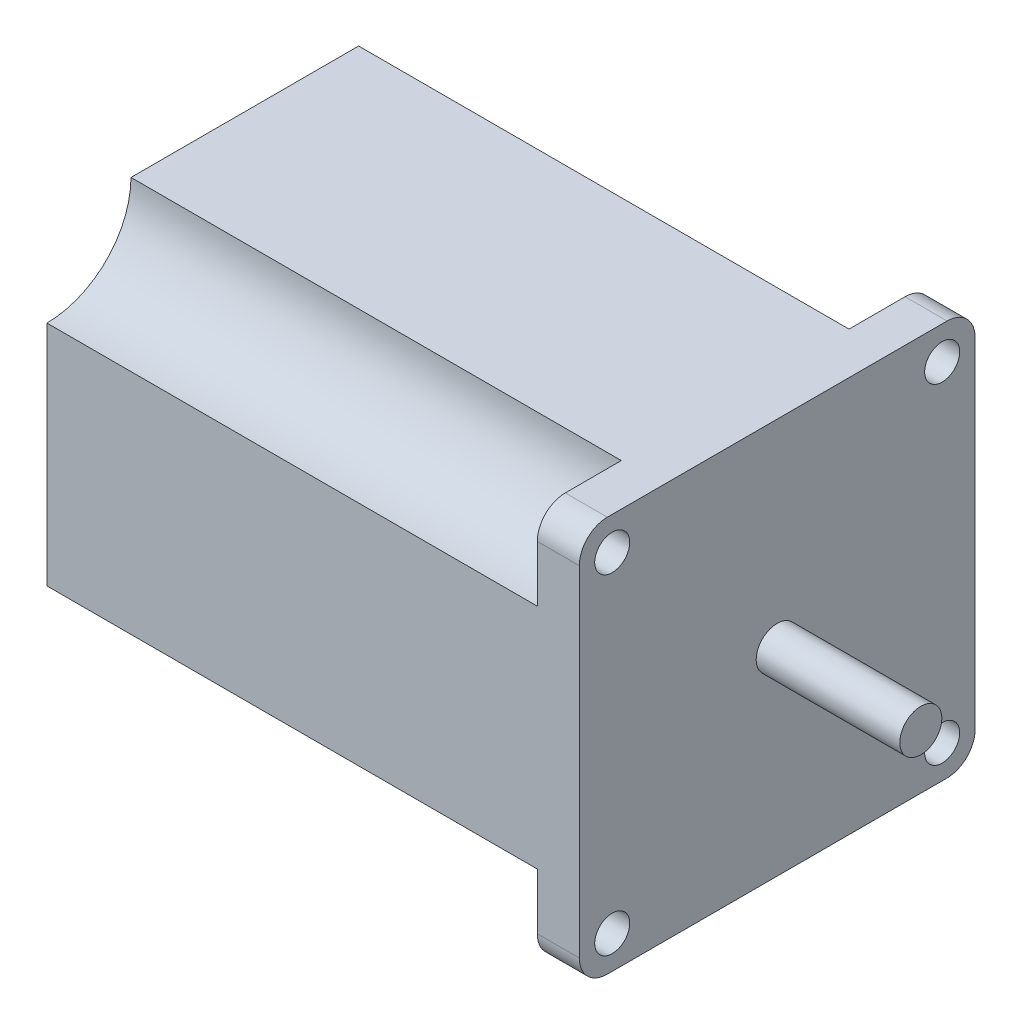
ISO-10303-21;
HEADER;
FILE_DESCRIPTION(('STEP AP214'),'2;1');
FILE_NAME('part.step','',(''),(''),'','','');
FILE_SCHEMA(('AUTOMOTIVE_DESIGN { 1 0 10303 214 1 1 1 1 }'));
ENDSEC;
DATA;
#1=APPLICATION_CONTEXT('core data for automotive mechanical design processes');
#2=APPLICATION_PROTOCOL_DEFINITION('international standard','automotive_design',2000,#1);
#3=PRODUCT_CONTEXT('',#1,'mechanical');
#4=PRODUCT('Part','Part','',(#3));
#5=PRODUCT_RELATED_PRODUCT_CATEGORY('part','',(#4));
#6=PRODUCT_DEFINITION_FORMATION('','',#4);
#7=PRODUCT_DEFINITION_CONTEXT('part definition',#1,'design');
#8=PRODUCT_DEFINITION('design','',#6,#7);
#9=PRODUCT_DEFINITION_SHAPE('','',#8);
#10=(LENGTH_UNIT() NAMED_UNIT(*) SI_UNIT(.MILLI.,.METRE.));
#11=(NAMED_UNIT(*) PLANE_ANGLE_UNIT() SI_UNIT($,.RADIAN.));
#12=(NAMED_UNIT(*) SI_UNIT($,.STERADIAN.) SOLID_ANGLE_UNIT());
#13=UNCERTAINTY_MEASURE_WITH_UNIT(LENGTH_MEASURE(1.E-05),#10,'distance_accuracy_value','');
#14=(GEOMETRIC_REPRESENTATION_CONTEXT(3) GLOBAL_UNCERTAINTY_ASSIGNED_CONTEXT((#13)) GLOBAL_UNIT_ASSIGNED_CONTEXT((#10,
#11,#12)) REPRESENTATION_CONTEXT('',''));
#15=CARTESIAN_POINT('',(0.,0.,0.));
#16=DIRECTION('',(0.,0.,1.));
#17=DIRECTION('',(1.,0.,0.));
#18=AXIS2_PLACEMENT_3D('',#15,#16,#17);
#19=CARTESIAN_POINT('',(-76.,-24.25,24.25));
#20=DIRECTION('',(1.,0.,0.));
#21=DIRECTION('',(0.,0.,-1.));
#22=AXIS2_PLACEMENT_3D('',#19,#20,#21);
#23=CYLINDRICAL_SURFACE('',#22,4.);
#24=DIRECTION('',(1.,0.,0.));
#25=VECTOR('',#24,1.);
#26=CARTESIAN_POINT('',(-76.,-24.25,28.25));
#27=LINE('',#26,#25);
#28=CARTESIAN_POINT('',(-6.,-24.25,28.25));
#29=VERTEX_POINT('',#28);
#30=CARTESIAN_POINT('',(0.,-24.25,28.25));
#31=VERTEX_POINT('',#30);
#32=EDGE_CURVE('E46',#29,#31,#27,.T.);
#33=ORIENTED_EDGE('',*,*,#32,.F.);
#34=CARTESIAN_POINT('',(-6.,-24.25,24.25));
#35=DIRECTION('',(-1.,0.,0.));
#36=DIRECTION('',(0.,0.,1.));
#37=AXIS2_PLACEMENT_3D('',#34,#35,#36);
#38=CIRCLE('',#37,4.);
#39=CARTESIAN_POINT('',(-6.,-28.25,24.25));
#40=VERTEX_POINT('',#39);
#41=EDGE_CURVE('E308',#29,#40,#38,.F.);
#42=ORIENTED_EDGE('',*,*,#41,.T.);
#43=DIRECTION('',(1.,0.,0.));
#44=VECTOR('',#43,1.);
#45=CARTESIAN_POINT('',(-76.,-28.25,24.25));
#46=LINE('',#45,#44);
#47=CARTESIAN_POINT('',(0.,-28.25,24.25));
#48=VERTEX_POINT('',#47);
#49=EDGE_CURVE('E184',#40,#48,#46,.T.);
#50=ORIENTED_EDGE('',*,*,#49,.T.);
#51=CARTESIAN_POINT('',(0.,-24.25,24.25));
#52=DIRECTION('',(1.,0.,0.));
#53=DIRECTION('',(0.,0.,1.));
#54=AXIS2_PLACEMENT_3D('',#51,#52,#53);
#55=CIRCLE('',#54,4.);
#56=EDGE_CURVE('E185',#31,#48,#55,.T.);
#57=ORIENTED_EDGE('',*,*,#56,.F.);
#58=EDGE_LOOP('',(#33,#42,#50,#57));
#59=FACE_BOUND('',#58,.T.);
#60=ADVANCED_FACE('F38',(#59),#23,.T.);
#61=CARTESIAN_POINT('',(-76.,-23.55,23.55));
#62=DIRECTION('',(1.,0.,0.));
#63=DIRECTION('',(0.,0.,-1.));
#64=AXIS2_PLACEMENT_3D('',#61,#62,#63);
#65=CYLINDRICAL_SURFACE('',#64,2.5);
#66=CARTESIAN_POINT('',(0.,-23.55,23.55));
#67=DIRECTION('',(1.,0.,0.));
#68=DIRECTION('',(0.,0.,-1.));
#69=AXIS2_PLACEMENT_3D('',#66,#67,#68);
#70=CIRCLE('',#69,2.5);
#71=CARTESIAN_POINT('',(0.,-23.55,21.05));
#72=VERTEX_POINT('',#71);
#73=EDGE_CURVE('E286',#72,#72,#70,.T.);
#74=ORIENTED_EDGE('',*,*,#73,.T.);
#75=EDGE_LOOP('',(#74));
#76=FACE_BOUND('',#75,.T.);
#77=CARTESIAN_POINT('',(-6.00000000000001,-23.55,23.55));
#78=DIRECTION('',(-1.,0.,0.));
#79=DIRECTION('',(0.,0.,1.));
#80=AXIS2_PLACEMENT_3D('',#77,#78,#79);
#81=CIRCLE('',#80,2.5);
#82=CARTESIAN_POINT('',(-6.00000000000001,-23.55,26.05));
#83=VERTEX_POINT('',#82);
#84=EDGE_CURVE('E41',#83,#83,#81,.F.);
#85=ORIENTED_EDGE('',*,*,#84,.F.);
#86=EDGE_LOOP('',(#85));
#87=FACE_BOUND('',#86,.T.);
#88=ADVANCED_FACE('F379',(#76,#87),#65,.F.);
#89=CARTESIAN_POINT('',(-76.,-24.25,-24.25));
#90=DIRECTION('',(1.,0.,0.));
#91=DIRECTION('',(0.,0.,-1.));
#92=AXIS2_PLACEMENT_3D('',#89,#90,#91);
#93=CYLINDRICAL_SURFACE('',#92,4.);
#94=DIRECTION('',(1.,0.,0.));
#95=VECTOR('',#94,1.);
#96=CARTESIAN_POINT('',(-76.,-28.25,-24.25));
#97=LINE('',#96,#95);
#98=CARTESIAN_POINT('',(-6.,-28.25,-24.25));
#99=VERTEX_POINT('',#98);
#100=CARTESIAN_POINT('',(0.,-28.25,-24.25));
#101=VERTEX_POINT('',#100);
#102=EDGE_CURVE('E216',#99,#101,#97,.T.);
#103=ORIENTED_EDGE('',*,*,#102,.F.);
#104=CARTESIAN_POINT('',(-6.,-24.25,-24.25));
#105=DIRECTION('',(-1.,0.,0.));
#106=DIRECTION('',(0.,0.,1.));
#107=AXIS2_PLACEMENT_3D('',#104,#105,#106);
#108=CIRCLE('',#107,4.);
#109=CARTESIAN_POINT('',(-6.,-24.25,-28.25));
#110=VERTEX_POINT('',#109);
#111=EDGE_CURVE('E346',#99,#110,#108,.F.);
#112=ORIENTED_EDGE('',*,*,#111,.T.);
#113=DIRECTION('',(1.,0.,0.));
#114=VECTOR('',#113,1.);
#115=CARTESIAN_POINT('',(-76.,-24.25,-28.25));
#116=LINE('',#115,#114);
#117=CARTESIAN_POINT('',(0.,-24.25,-28.25));
#118=VERTEX_POINT('',#117);
#119=EDGE_CURVE('E214',#110,#118,#116,.T.);
#120=ORIENTED_EDGE('',*,*,#119,.T.);
#121=CARTESIAN_POINT('',(0.,-24.25,-24.25));
#122=DIRECTION('',(1.,0.,0.));
#123=DIRECTION('',(0.,0.,-1.));
#124=AXIS2_PLACEMENT_3D('',#121,#122,#123);
#125=CIRCLE('',#124,4.);
#126=EDGE_CURVE('E191',#101,#118,#125,.T.);
#127=ORIENTED_EDGE('',*,*,#126,.F.);
#128=EDGE_LOOP('',(#103,#112,#120,#127));
#129=FACE_BOUND('',#128,.T.);
#130=ADVANCED_FACE('F315',(#129),#93,.T.);
#131=CARTESIAN_POINT('',(-76.,-23.55,-23.55));
#132=DIRECTION('',(1.,0.,0.));
#133=DIRECTION('',(0.,0.,-1.));
#134=AXIS2_PLACEMENT_3D('',#131,#132,#133);
#135=CYLINDRICAL_SURFACE('',#134,2.5);
#136=CARTESIAN_POINT('',(0.,-23.55,-23.55));
#137=DIRECTION('',(1.,0.,0.));
#138=DIRECTION('',(0.,0.,-1.));
#139=AXIS2_PLACEMENT_3D('',#136,#137,#138);
#140=CIRCLE('',#139,2.5);
#141=CARTESIAN_POINT('',(0.,-23.55,-26.05));
#142=VERTEX_POINT('',#141);
#143=EDGE_CURVE('E284',#142,#142,#140,.T.);
#144=ORIENTED_EDGE('',*,*,#143,.T.);
#145=EDGE_LOOP('',(#144));
#146=FACE_BOUND('',#145,.T.);
#147=CARTESIAN_POINT('',(-6.00000000000001,-23.55,-23.55));
#148=DIRECTION('',(-1.,0.,0.));
#149=DIRECTION('',(0.,0.,1.));
#150=AXIS2_PLACEMENT_3D('',#147,#148,#149);
#151=CIRCLE('',#150,2.5);
#152=CARTESIAN_POINT('',(-6.00000000000001,-23.55,-21.05));
#153=VERTEX_POINT('',#152);
#154=EDGE_CURVE('E228',#153,#153,#151,.F.);
#155=ORIENTED_EDGE('',*,*,#154,.F.);
#156=EDGE_LOOP('',(#155));
#157=FACE_BOUND('',#156,.T.);
#158=ADVANCED_FACE('F387',(#146,#157),#135,.F.);
#159=CARTESIAN_POINT('',(-76.,24.25,24.25));
#160=DIRECTION('',(1.,0.,0.));
#161=DIRECTION('',(0.,0.,-1.));
#162=AXIS2_PLACEMENT_3D('',#159,#160,#161);
#163=CYLINDRICAL_SURFACE('',#162,4.);
#164=DIRECTION('',(1.,0.,0.));
#165=VECTOR('',#164,1.);
#166=CARTESIAN_POINT('',(-76.,28.25,24.25));
#167=LINE('',#166,#165);
#168=CARTESIAN_POINT('',(-6.,28.25,24.25));
#169=VERTEX_POINT('',#168);
#170=CARTESIAN_POINT('',(0.,28.25,24.25));
#171=VERTEX_POINT('',#170);
#172=EDGE_CURVE('E208',#169,#171,#167,.T.);
#173=ORIENTED_EDGE('',*,*,#172,.F.);
#174=CARTESIAN_POINT('',(-6.,24.25,24.25));
#175=DIRECTION('',(-1.,0.,0.));
#176=DIRECTION('',(0.,0.,1.));
#177=AXIS2_PLACEMENT_3D('',#174,#175,#176);
#178=CIRCLE('',#177,4.);
#179=CARTESIAN_POINT('',(-6.,24.25,28.25));
#180=VERTEX_POINT('',#179);
#181=EDGE_CURVE('E248',#169,#180,#178,.F.);
#182=ORIENTED_EDGE('',*,*,#181,.T.);
#183=DIRECTION('',(1.,0.,0.));
#184=VECTOR('',#183,1.);
#185=CARTESIAN_POINT('',(-76.,24.25,28.25));
#186=LINE('',#185,#184);
#187=CARTESIAN_POINT('',(0.,24.25,28.25));
#188=VERTEX_POINT('',#187);
#189=EDGE_CURVE('E206',#180,#188,#186,.T.);
#190=ORIENTED_EDGE('',*,*,#189,.T.);
#191=CARTESIAN_POINT('',(0.,24.25,24.25));
#192=DIRECTION('',(1.,0.,0.));
#193=DIRECTION('',(0.,0.,1.));
#194=AXIS2_PLACEMENT_3D('',#191,#192,#193);
#195=CIRCLE('',#194,4.);
#196=EDGE_CURVE('E174',#171,#188,#195,.T.);
#197=ORIENTED_EDGE('',*,*,#196,.F.);
#198=EDGE_LOOP('',(#173,#182,#190,#197));
#199=FACE_BOUND('',#198,.T.);
#200=ADVANCED_FACE('F393',(#199),#163,.T.);
#201=CARTESIAN_POINT('',(-76.,23.55,23.55));
#202=DIRECTION('',(1.,0.,0.));
#203=DIRECTION('',(0.,0.,-1.));
#204=AXIS2_PLACEMENT_3D('',#201,#202,#203);
#205=CYLINDRICAL_SURFACE('',#204,2.5);
#206=CARTESIAN_POINT('',(0.,23.55,23.55));
#207=DIRECTION('',(1.,0.,0.));
#208=DIRECTION('',(0.,0.,-1.));
#209=AXIS2_PLACEMENT_3D('',#206,#207,#208);
#210=CIRCLE('',#209,2.5);
#211=CARTESIAN_POINT('',(0.,23.55,21.05));
#212=VERTEX_POINT('',#211);
#213=EDGE_CURVE('E177',#212,#212,#210,.T.);
#214=ORIENTED_EDGE('',*,*,#213,.T.);
#215=EDGE_LOOP('',(#214));
#216=FACE_BOUND('',#215,.T.);
#217=CARTESIAN_POINT('',(-6.00000000000001,23.55,23.55));
#218=DIRECTION('',(-1.,0.,0.));
#219=DIRECTION('',(0.,0.,1.));
#220=AXIS2_PLACEMENT_3D('',#217,#218,#219);
#221=CIRCLE('',#220,2.5);
#222=CARTESIAN_POINT('',(-6.00000000000001,23.55,26.05));
#223=VERTEX_POINT('',#222);
#224=EDGE_CURVE('E224',#223,#223,#221,.F.);
#225=ORIENTED_EDGE('',*,*,#224,.F.);
#226=EDGE_LOOP('',(#225));
#227=FACE_BOUND('',#226,.T.);
#228=ADVANCED_FACE('F293',(#216,#227),#205,.F.);
#229=CARTESIAN_POINT('',(-76.,24.25,-24.25));
#230=DIRECTION('',(1.,0.,0.));
#231=DIRECTION('',(0.,0.,-1.));
#232=AXIS2_PLACEMENT_3D('',#229,#230,#231);
#233=CYLINDRICAL_SURFACE('',#232,4.);
#234=DIRECTION('',(1.,0.,0.));
#235=VECTOR('',#234,1.);
#236=CARTESIAN_POINT('',(-76.,24.25,-28.25));
#237=LINE('',#236,#235);
#238=CARTESIAN_POINT('',(-6.,24.25,-28.25));
#239=VERTEX_POINT('',#238);
#240=CARTESIAN_POINT('',(0.,24.25,-28.25));
#241=VERTEX_POINT('',#240);
#242=EDGE_CURVE('E212',#239,#241,#237,.T.);
#243=ORIENTED_EDGE('',*,*,#242,.F.);
#244=CARTESIAN_POINT('',(-6.,24.25,-24.25));
#245=DIRECTION('',(-1.,0.,0.));
#246=DIRECTION('',(0.,0.,1.));
#247=AXIS2_PLACEMENT_3D('',#244,#245,#246);
#248=CIRCLE('',#247,4.);
#249=CARTESIAN_POINT('',(-6.,28.25,-24.25));
#250=VERTEX_POINT('',#249);
#251=EDGE_CURVE('E262',#239,#250,#248,.F.);
#252=ORIENTED_EDGE('',*,*,#251,.T.);
#253=DIRECTION('',(1.,0.,0.));
#254=VECTOR('',#253,1.);
#255=CARTESIAN_POINT('',(-76.,28.25,-24.25));
#256=LINE('',#255,#254);
#257=CARTESIAN_POINT('',(0.,28.25,-24.25));
#258=VERTEX_POINT('',#257);
#259=EDGE_CURVE('E210',#250,#258,#256,.T.);
#260=ORIENTED_EDGE('',*,*,#259,.T.);
#261=CARTESIAN_POINT('',(0.,24.25,-24.25));
#262=DIRECTION('',(1.,0.,0.));
#263=DIRECTION('',(0.,0.,1.));
#264=AXIS2_PLACEMENT_3D('',#261,#262,#263);
#265=CIRCLE('',#264,4.);
#266=EDGE_CURVE('E197',#241,#258,#265,.T.);
#267=ORIENTED_EDGE('',*,*,#266,.F.);
#268=EDGE_LOOP('',(#243,#252,#260,#267));
#269=FACE_BOUND('',#268,.T.);
#270=ADVANCED_FACE('F323',(#269),#233,.T.);
#271=CARTESIAN_POINT('',(-76.,23.55,-23.55));
#272=DIRECTION('',(1.,0.,0.));
#273=DIRECTION('',(0.,0.,-1.));
#274=AXIS2_PLACEMENT_3D('',#271,#272,#273);
#275=CYLINDRICAL_SURFACE('',#274,2.5);
#276=CARTESIAN_POINT('',(0.,23.55,-23.55));
#277=DIRECTION('',(1.,0.,0.));
#278=DIRECTION('',(0.,0.,-1.));
#279=AXIS2_PLACEMENT_3D('',#276,#277,#278);
#280=CIRCLE('',#279,2.5);
#281=CARTESIAN_POINT('',(0.,23.55,-26.05));
#282=VERTEX_POINT('',#281);
#283=EDGE_CURVE('E281',#282,#282,#280,.T.);
#284=ORIENTED_EDGE('',*,*,#283,.T.);
#285=EDGE_LOOP('',(#284));
#286=FACE_BOUND('',#285,.T.);
#287=CARTESIAN_POINT('',(-6.00000000000001,23.55,-23.55));
#288=DIRECTION('',(-1.,0.,0.));
#289=DIRECTION('',(0.,0.,1.));
#290=AXIS2_PLACEMENT_3D('',#287,#288,#289);
#291=CIRCLE('',#290,2.5);
#292=CARTESIAN_POINT('',(-6.00000000000001,23.55,-21.05));
#293=VERTEX_POINT('',#292);
#294=EDGE_CURVE('E219',#293,#293,#291,.F.);
#295=ORIENTED_EDGE('',*,*,#294,.F.);
#296=EDGE_LOOP('',(#295));
#297=FACE_BOUND('',#296,.T.);
#298=ADVANCED_FACE('F366',(#286,#297),#275,.F.);
#299=CARTESIAN_POINT('',(-76.,-24.25,28.25));
#300=DIRECTION('',(0.,0.,1.));
#301=DIRECTION('',(1.,0.,0.));
#302=AXIS2_PLACEMENT_3D('',#299,#300,#301);
#303=PLANE('',#302);
#304=DIRECTION('',(-1.,0.,0.));
#305=VECTOR('',#304,1.);
#306=CARTESIAN_POINT('',(16.9705627484772,-16.25,28.25));
#307=LINE('',#306,#305);
#308=CARTESIAN_POINT('',(-6.,-16.25,28.25));
#309=VERTEX_POINT('',#308);
#310=CARTESIAN_POINT('',(-76.,-16.25,28.25));
#311=VERTEX_POINT('',#310);
#312=EDGE_CURVE('E54',#309,#311,#307,.T.);
#313=ORIENTED_EDGE('',*,*,#312,.F.);
#314=DIRECTION('',(0.,-1.,0.));
#315=VECTOR('',#314,1.);
#316=CARTESIAN_POINT('',(-6.,-24.25,28.25));
#317=LINE('',#316,#315);
#318=EDGE_CURVE('E337',#309,#29,#317,.T.);
#319=ORIENTED_EDGE('',*,*,#318,.T.);
#320=ORIENTED_EDGE('',*,*,#32,.T.);
#321=DIRECTION('',(0.,-1.,0.));
#322=VECTOR('',#321,1.);
#323=CARTESIAN_POINT('',(0.,-24.25,28.25));
#324=LINE('',#323,#322);
#325=EDGE_CURVE('E169',#188,#31,#324,.T.);
#326=ORIENTED_EDGE('',*,*,#325,.F.);
#327=ORIENTED_EDGE('',*,*,#189,.F.);
#328=DIRECTION('',(0.,-1.,0.));
#329=VECTOR('',#328,1.);
#330=CARTESIAN_POINT('',(-6.,16.25,28.25));
#331=LINE('',#330,#329);
#332=CARTESIAN_POINT('',(-6.,16.25,28.25));
#333=VERTEX_POINT('',#332);
#334=EDGE_CURVE('E227',#180,#333,#331,.T.);
#335=ORIENTED_EDGE('',*,*,#334,.T.);
#336=DIRECTION('',(-1.,0.,0.));
#337=VECTOR('',#336,1.);
#338=CARTESIAN_POINT('',(16.9705627484772,16.25,28.25));
#339=LINE('',#338,#337);
#340=CARTESIAN_POINT('',(-76.,16.25,28.25));
#341=VERTEX_POINT('',#340);
#342=EDGE_CURVE('E234',#333,#341,#339,.T.);
#343=ORIENTED_EDGE('',*,*,#342,.T.);
#344=DIRECTION('',(0.,-1.,0.));
#345=VECTOR('',#344,1.);
#346=CARTESIAN_POINT('',(-76.,-24.25,28.25));
#347=LINE('',#346,#345);
#348=EDGE_CURVE('E182',#341,#311,#347,.T.);
#349=ORIENTED_EDGE('',*,*,#348,.T.);
#350=EDGE_LOOP('',(#313,#319,#320,#326,#327,#335,#343,#349));
#351=FACE_BOUND('',#350,.T.);
#352=ADVANCED_FACE('F334',(#351),#303,.T.);
#353=CARTESIAN_POINT('',(-76.,28.25,24.25));
#354=DIRECTION('',(0.,1.,0.));
#355=DIRECTION('',(0.,0.,1.));
#356=AXIS2_PLACEMENT_3D('',#353,#354,#355);
#357=PLANE('',#356);
#358=DIRECTION('',(-1.,0.,0.));
#359=VECTOR('',#358,1.);
#360=CARTESIAN_POINT('',(16.9705627484772,28.25,16.25));
#361=LINE('',#360,#359);
#362=CARTESIAN_POINT('',(-6.,28.25,16.25));
#363=VERTEX_POINT('',#362);
#364=CARTESIAN_POINT('',(-76.,28.25,16.25));
#365=VERTEX_POINT('',#364);
#366=EDGE_CURVE('E252',#363,#365,#361,.T.);
#367=ORIENTED_EDGE('',*,*,#366,.F.);
#368=DIRECTION('',(0.,0.,1.));
#369=VECTOR('',#368,1.);
#370=CARTESIAN_POINT('',(-6.,28.25,24.25));
#371=LINE('',#370,#369);
#372=EDGE_CURVE('E251',#363,#169,#371,.T.);
#373=ORIENTED_EDGE('',*,*,#372,.T.);
#374=ORIENTED_EDGE('',*,*,#172,.T.);
#375=DIRECTION('',(0.,0.,1.));
#376=VECTOR('',#375,1.);
#377=CARTESIAN_POINT('',(0.,28.25,24.25));
#378=LINE('',#377,#376);
#379=EDGE_CURVE('E200',#258,#171,#378,.T.);
#380=ORIENTED_EDGE('',*,*,#379,.F.);
#381=ORIENTED_EDGE('',*,*,#259,.F.);
#382=DIRECTION('',(0.,0.,1.));
#383=VECTOR('',#382,1.);
#384=CARTESIAN_POINT('',(-6.,28.25,-16.25));
#385=LINE('',#384,#383);
#386=CARTESIAN_POINT('',(-6.,28.25,-16.25));
#387=VERTEX_POINT('',#386);
#388=EDGE_CURVE('E223',#250,#387,#385,.T.);
#389=ORIENTED_EDGE('',*,*,#388,.T.);
#390=DIRECTION('',(-1.,0.,0.));
#391=VECTOR('',#390,1.);
#392=CARTESIAN_POINT('',(16.9705627484772,28.25,-16.25));
#393=LINE('',#392,#391);
#394=CARTESIAN_POINT('',(-76.,28.25,-16.25));
#395=VERTEX_POINT('',#394);
#396=EDGE_CURVE('E272',#387,#395,#393,.T.);
#397=ORIENTED_EDGE('',*,*,#396,.T.);
#398=DIRECTION('',(0.,0.,1.));
#399=VECTOR('',#398,1.);
#400=CARTESIAN_POINT('',(-76.,28.25,24.25));
#401=LINE('',#400,#399);
#402=EDGE_CURVE('E171',#395,#365,#401,.T.);
#403=ORIENTED_EDGE('',*,*,#402,.T.);
#404=EDGE_LOOP('',(#367,#373,#374,#380,#381,#389,#397,#403));
#405=FACE_BOUND('',#404,.T.);
#406=ADVANCED_FACE('F328',(#405),#357,.T.);
#407=CARTESIAN_POINT('',(-76.,-24.25,-28.25));
#408=DIRECTION('',(0.,0.,-1.));
#409=DIRECTION('',(-1.,0.,0.));
#410=AXIS2_PLACEMENT_3D('',#407,#408,#409);
#411=PLANE('',#410);
#412=DIRECTION('',(-1.,0.,0.));
#413=VECTOR('',#412,1.);
#414=CARTESIAN_POINT('',(16.9705627484772,-16.25,-28.25));
#415=LINE('',#414,#413);
#416=CARTESIAN_POINT('',(-6.,-16.25,-28.25));
#417=VERTEX_POINT('',#416);
#418=CARTESIAN_POINT('',(-76.,-16.25,-28.25));
#419=VERTEX_POINT('',#418);
#420=EDGE_CURVE('E246',#417,#419,#415,.T.);
#421=ORIENTED_EDGE('',*,*,#420,.T.);
#422=DIRECTION('',(0.,1.,0.));
#423=VECTOR('',#422,1.);
#424=CARTESIAN_POINT('',(-76.,-24.25,-28.25));
#425=LINE('',#424,#423);
#426=CARTESIAN_POINT('',(-76.,16.25,-28.25));
#427=VERTEX_POINT('',#426);
#428=EDGE_CURVE('E168',#419,#427,#425,.T.);
#429=ORIENTED_EDGE('',*,*,#428,.T.);
#430=DIRECTION('',(-1.,0.,0.));
#431=VECTOR('',#430,1.);
#432=CARTESIAN_POINT('',(16.9705627484772,16.25,-28.25));
#433=LINE('',#432,#431);
#434=CARTESIAN_POINT('',(-6.,16.25,-28.25));
#435=VERTEX_POINT('',#434);
#436=EDGE_CURVE('E266',#435,#427,#433,.T.);
#437=ORIENTED_EDGE('',*,*,#436,.F.);
#438=DIRECTION('',(0.,1.,0.));
#439=VECTOR('',#438,1.);
#440=CARTESIAN_POINT('',(-6.,24.25,-28.25));
#441=LINE('',#440,#439);
#442=EDGE_CURVE('E265',#435,#239,#441,.T.);
#443=ORIENTED_EDGE('',*,*,#442,.T.);
#444=ORIENTED_EDGE('',*,*,#242,.T.);
#445=DIRECTION('',(0.,1.,0.));
#446=VECTOR('',#445,1.);
#447=CARTESIAN_POINT('',(0.,-24.25,-28.25));
#448=LINE('',#447,#446);
#449=EDGE_CURVE('E194',#118,#241,#448,.T.);
#450=ORIENTED_EDGE('',*,*,#449,.F.);
#451=ORIENTED_EDGE('',*,*,#119,.F.);
#452=DIRECTION('',(0.,1.,0.));
#453=VECTOR('',#452,1.);
#454=CARTESIAN_POINT('',(-6.,-16.25,-28.25));
#455=LINE('',#454,#453);
#456=EDGE_CURVE('E231',#110,#417,#455,.T.);
#457=ORIENTED_EDGE('',*,*,#456,.T.);
#458=EDGE_LOOP('',(#421,#429,#437,#443,#444,#450,#451,#457));
#459=FACE_BOUND('',#458,.T.);
#460=ADVANCED_FACE('F318',(#459),#411,.T.);
#461=CARTESIAN_POINT('',(-76.,-28.25,24.25));
#462=DIRECTION('',(0.,-1.,0.));
#463=DIRECTION('',(0.,0.,-1.));
#464=AXIS2_PLACEMENT_3D('',#461,#462,#463);
#465=PLANE('',#464);
#466=DIRECTION('',(-1.,0.,0.));
#467=VECTOR('',#466,1.);
#468=CARTESIAN_POINT('',(16.9705627484772,-28.25,16.25));
#469=LINE('',#468,#467);
#470=CARTESIAN_POINT('',(-6.,-28.25,16.25));
#471=VERTEX_POINT('',#470);
#472=CARTESIAN_POINT('',(-76.,-28.25,16.25));
#473=VERTEX_POINT('',#472);
#474=EDGE_CURVE('E154',#471,#473,#469,.T.);
#475=ORIENTED_EDGE('',*,*,#474,.T.);
#476=DIRECTION('',(0.,0.,-1.));
#477=VECTOR('',#476,1.);
#478=CARTESIAN_POINT('',(-76.,-28.25,24.25));
#479=LINE('',#478,#477);
#480=CARTESIAN_POINT('',(-76.,-28.25,-16.25));
#481=VERTEX_POINT('',#480);
#482=EDGE_CURVE('E62',#473,#481,#479,.T.);
#483=ORIENTED_EDGE('',*,*,#482,.T.);
#484=DIRECTION('',(-1.,0.,0.));
#485=VECTOR('',#484,1.);
#486=CARTESIAN_POINT('',(16.9705627484772,-28.25,-16.25));
#487=LINE('',#486,#485);
#488=CARTESIAN_POINT('',(-6.,-28.25,-16.25));
#489=VERTEX_POINT('',#488);
#490=EDGE_CURVE('E348',#489,#481,#487,.T.);
#491=ORIENTED_EDGE('',*,*,#490,.F.);
#492=DIRECTION('',(0.,0.,-1.));
#493=VECTOR('',#492,1.);
#494=CARTESIAN_POINT('',(-6.,-28.25,-24.25));
#495=LINE('',#494,#493);
#496=EDGE_CURVE('E242',#489,#99,#495,.T.);
#497=ORIENTED_EDGE('',*,*,#496,.T.);
#498=ORIENTED_EDGE('',*,*,#102,.T.);
#499=DIRECTION('',(0.,0.,-1.));
#500=VECTOR('',#499,1.);
#501=CARTESIAN_POINT('',(0.,-28.25,24.25));
#502=LINE('',#501,#500);
#503=EDGE_CURVE('E188',#48,#101,#502,.T.);
#504=ORIENTED_EDGE('',*,*,#503,.F.);
#505=ORIENTED_EDGE('',*,*,#49,.F.);
#506=DIRECTION('',(0.,0.,-1.));
#507=VECTOR('',#506,1.);
#508=CARTESIAN_POINT('',(-6.,-28.25,16.25));
#509=LINE('',#508,#507);
#510=EDGE_CURVE('E162',#40,#471,#509,.T.);
#511=ORIENTED_EDGE('',*,*,#510,.T.);
#512=EDGE_LOOP('',(#475,#483,#491,#497,#498,#504,#505,#511));
#513=FACE_BOUND('',#512,.T.);
#514=ADVANCED_FACE('F160',(#513),#465,.T.);
#515=CARTESIAN_POINT('',(-76.,-24.25,24.25));
#516=DIRECTION('',(-1.,0.,0.));
#517=DIRECTION('',(0.,0.,1.));
#518=AXIS2_PLACEMENT_3D('',#515,#516,#517);
#519=PLANE('',#518);
#520=CARTESIAN_POINT('',(-76.,-28.25,28.25));
#521=DIRECTION('',(-1.,0.,0.));
#522=DIRECTION('',(0.,0.,1.));
#523=AXIS2_PLACEMENT_3D('',#520,#521,#522);
#524=CIRCLE('',#523,12.);
#525=EDGE_CURVE('E152',#311,#473,#524,.T.);
#526=ORIENTED_EDGE('',*,*,#525,.F.);
#527=ORIENTED_EDGE('',*,*,#348,.F.);
#528=CARTESIAN_POINT('',(-76.,28.25,28.25));
#529=DIRECTION('',(-1.,0.,0.));
#530=DIRECTION('',(0.,0.,1.));
#531=AXIS2_PLACEMENT_3D('',#528,#529,#530);
#532=CIRCLE('',#531,12.);
#533=EDGE_CURVE('E230',#365,#341,#532,.T.);
#534=ORIENTED_EDGE('',*,*,#533,.F.);
#535=ORIENTED_EDGE('',*,*,#402,.F.);
#536=CARTESIAN_POINT('',(-76.,28.25,-28.25));
#537=DIRECTION('',(-1.,0.,0.));
#538=DIRECTION('',(0.,0.,1.));
#539=AXIS2_PLACEMENT_3D('',#536,#537,#538);
#540=CIRCLE('',#539,12.);
#541=EDGE_CURVE('E226',#427,#395,#540,.T.);
#542=ORIENTED_EDGE('',*,*,#541,.F.);
#543=ORIENTED_EDGE('',*,*,#428,.F.);
#544=CARTESIAN_POINT('',(-76.,-28.25,-28.25));
#545=DIRECTION('',(-1.,0.,0.));
#546=DIRECTION('',(0.,0.,-1.));
#547=AXIS2_PLACEMENT_3D('',#544,#545,#546);
#548=CIRCLE('',#547,12.);
#549=EDGE_CURVE('E167',#481,#419,#548,.T.);
#550=ORIENTED_EDGE('',*,*,#549,.F.);
#551=ORIENTED_EDGE('',*,*,#482,.F.);
#552=EDGE_LOOP('',(#526,#527,#534,#535,#542,#543,#550,#551));
#553=FACE_BOUND('',#552,.T.);
#554=ADVANCED_FACE('F165',(#553),#519,.T.);
#555=CARTESIAN_POINT('',(0.,-24.25,24.25));
#556=DIRECTION('',(-1.,0.,0.));
#557=DIRECTION('',(0.,0.,1.));
#558=AXIS2_PLACEMENT_3D('',#555,#556,#557);
#559=PLANE('',#558);
#560=CARTESIAN_POINT('',(0.,0.,0.));
#561=DIRECTION('',(-1.,0.,0.));
#562=DIRECTION('',(0.,0.,1.));
#563=AXIS2_PLACEMENT_3D('',#560,#561,#562);
#564=CIRCLE('',#563,3.);
#565=CARTESIAN_POINT('',(0.,0.,3.));
#566=VERTEX_POINT('',#565);
#567=EDGE_CURVE('E12',#566,#566,#564,.F.);
#568=ORIENTED_EDGE('',*,*,#567,.F.);
#569=EDGE_LOOP('',(#568));
#570=FACE_BOUND('',#569,.T.);
#571=ORIENTED_EDGE('',*,*,#283,.F.);
#572=EDGE_LOOP('',(#571));
#573=FACE_BOUND('',#572,.T.);
#574=ORIENTED_EDGE('',*,*,#143,.F.);
#575=EDGE_LOOP('',(#574));
#576=FACE_BOUND('',#575,.T.);
#577=ORIENTED_EDGE('',*,*,#73,.F.);
#578=EDGE_LOOP('',(#577));
#579=FACE_BOUND('',#578,.T.);
#580=ORIENTED_EDGE('',*,*,#213,.F.);
#581=EDGE_LOOP('',(#580));
#582=FACE_BOUND('',#581,.T.);
#583=ORIENTED_EDGE('',*,*,#56,.T.);
#584=ORIENTED_EDGE('',*,*,#503,.T.);
#585=ORIENTED_EDGE('',*,*,#126,.T.);
#586=ORIENTED_EDGE('',*,*,#449,.T.);
#587=ORIENTED_EDGE('',*,*,#266,.T.);
#588=ORIENTED_EDGE('',*,*,#379,.T.);
#589=ORIENTED_EDGE('',*,*,#196,.T.);
#590=ORIENTED_EDGE('',*,*,#325,.T.);
#591=EDGE_LOOP('',(#583,#584,#585,#586,#587,#588,#589,#590));
#592=FACE_BOUND('',#591,.T.);
#593=ADVANCED_FACE('F296',(#570,#573,#576,#579,#582,#592),#559,.F.);
#594=CARTESIAN_POINT('',(20.5,0.,0.));
#595=DIRECTION('',(-1.,0.,0.));
#596=DIRECTION('',(0.,0.,1.));
#597=AXIS2_PLACEMENT_3D('',#594,#595,#596);
#598=PLANE('',#597);
#599=CARTESIAN_POINT('',(20.5,0.,0.));
#600=DIRECTION('',(-1.,0.,0.));
#601=DIRECTION('',(0.,0.,1.));
#602=AXIS2_PLACEMENT_3D('',#599,#600,#601);
#603=CIRCLE('',#602,3.);
#604=CARTESIAN_POINT('',(20.5,0.,3.));
#605=VERTEX_POINT('',#604);
#606=EDGE_CURVE('E222',#605,#605,#603,.T.);
#607=ORIENTED_EDGE('',*,*,#606,.F.);
#608=EDGE_LOOP('',(#607));
#609=FACE_BOUND('',#608,.T.);
#610=ADVANCED_FACE('F299',(#609),#598,.F.);
#611=CARTESIAN_POINT('',(0.,0.,0.));
#612=DIRECTION('',(-1.,0.,0.));
#613=DIRECTION('',(0.,0.,1.));
#614=AXIS2_PLACEMENT_3D('',#611,#612,#613);
#615=CYLINDRICAL_SURFACE('',#614,3.);
#616=ORIENTED_EDGE('',*,*,#567,.T.);
#617=EDGE_LOOP('',(#616));
#618=FACE_BOUND('',#617,.T.);
#619=ORIENTED_EDGE('',*,*,#606,.T.);
#620=EDGE_LOOP('',(#619));
#621=FACE_BOUND('',#620,.T.);
#622=ADVANCED_FACE('F362',(#618,#621),#615,.T.);
#623=CARTESIAN_POINT('',(-6.,-24.25,24.25));
#624=DIRECTION('',(-1.,0.,0.));
#625=DIRECTION('',(0.,0.,1.));
#626=AXIS2_PLACEMENT_3D('',#623,#624,#625);
#627=PLANE('',#626);
#628=CARTESIAN_POINT('',(-6.,28.25,-28.25));
#629=DIRECTION('',(-1.,0.,0.));
#630=DIRECTION('',(0.,0.,1.));
#631=AXIS2_PLACEMENT_3D('',#628,#629,#630);
#632=CIRCLE('',#631,12.);
#633=EDGE_CURVE('E269',#387,#435,#632,.F.);
#634=ORIENTED_EDGE('',*,*,#633,.F.);
#635=ORIENTED_EDGE('',*,*,#388,.F.);
#636=ORIENTED_EDGE('',*,*,#251,.F.);
#637=ORIENTED_EDGE('',*,*,#442,.F.);
#638=EDGE_LOOP('',(#634,#635,#636,#637));
#639=FACE_BOUND('',#638,.T.);
#640=ORIENTED_EDGE('',*,*,#294,.T.);
#641=EDGE_LOOP('',(#640));
#642=FACE_BOUND('',#641,.T.);
#643=ADVANCED_FACE('F359',(#639,#642),#627,.T.);
#644=CARTESIAN_POINT('',(16.9705627484772,28.25,-28.25));
#645=DIRECTION('',(-1.,0.,0.));
#646=DIRECTION('',(0.,0.,1.));
#647=AXIS2_PLACEMENT_3D('',#644,#645,#646);
#648=CYLINDRICAL_SURFACE('',#647,12.);
#649=ORIENTED_EDGE('',*,*,#633,.T.);
#650=ORIENTED_EDGE('',*,*,#436,.T.);
#651=ORIENTED_EDGE('',*,*,#541,.T.);
#652=ORIENTED_EDGE('',*,*,#396,.F.);
#653=EDGE_LOOP('',(#649,#650,#651,#652));
#654=FACE_BOUND('',#653,.T.);
#655=ADVANCED_FACE('F357',(#654),#648,.F.);
#656=CARTESIAN_POINT('',(-6.,-24.25,24.25));
#657=DIRECTION('',(-1.,0.,0.));
#658=DIRECTION('',(0.,0.,1.));
#659=AXIS2_PLACEMENT_3D('',#656,#657,#658);
#660=PLANE('',#659);
#661=CARTESIAN_POINT('',(-6.,28.25,28.25));
#662=DIRECTION('',(-1.,0.,0.));
#663=DIRECTION('',(0.,0.,1.));
#664=AXIS2_PLACEMENT_3D('',#661,#662,#663);
#665=CIRCLE('',#664,12.);
#666=EDGE_CURVE('E255',#333,#363,#665,.F.);
#667=ORIENTED_EDGE('',*,*,#666,.F.);
#668=ORIENTED_EDGE('',*,*,#334,.F.);
#669=ORIENTED_EDGE('',*,*,#181,.F.);
#670=ORIENTED_EDGE('',*,*,#372,.F.);
#671=EDGE_LOOP('',(#667,#668,#669,#670));
#672=FACE_BOUND('',#671,.T.);
#673=ORIENTED_EDGE('',*,*,#224,.T.);
#674=EDGE_LOOP('',(#673));
#675=FACE_BOUND('',#674,.T.);
#676=ADVANCED_FACE('F440',(#672,#675),#660,.T.);
#677=CARTESIAN_POINT('',(16.9705627484772,28.25,28.25));
#678=DIRECTION('',(-1.,0.,0.));
#679=DIRECTION('',(0.,0.,1.));
#680=AXIS2_PLACEMENT_3D('',#677,#678,#679);
#681=CYLINDRICAL_SURFACE('',#680,12.);
#682=ORIENTED_EDGE('',*,*,#666,.T.);
#683=ORIENTED_EDGE('',*,*,#366,.T.);
#684=ORIENTED_EDGE('',*,*,#533,.T.);
#685=ORIENTED_EDGE('',*,*,#342,.F.);
#686=EDGE_LOOP('',(#682,#683,#684,#685));
#687=FACE_BOUND('',#686,.T.);
#688=ADVANCED_FACE('F448',(#687),#681,.F.);
#689=CARTESIAN_POINT('',(-6.,-24.25,24.25));
#690=DIRECTION('',(-1.,0.,0.));
#691=DIRECTION('',(0.,0.,1.));
#692=AXIS2_PLACEMENT_3D('',#689,#690,#691);
#693=PLANE('',#692);
#694=CARTESIAN_POINT('',(-6.,-28.25,-28.25));
#695=DIRECTION('',(-1.,0.,0.));
#696=DIRECTION('',(0.,0.,1.));
#697=AXIS2_PLACEMENT_3D('',#694,#695,#696);
#698=CIRCLE('',#697,12.);
#699=EDGE_CURVE('E237',#417,#489,#698,.F.);
#700=ORIENTED_EDGE('',*,*,#699,.F.);
#701=ORIENTED_EDGE('',*,*,#456,.F.);
#702=ORIENTED_EDGE('',*,*,#111,.F.);
#703=ORIENTED_EDGE('',*,*,#496,.F.);
#704=EDGE_LOOP('',(#700,#701,#702,#703));
#705=FACE_BOUND('',#704,.T.);
#706=ORIENTED_EDGE('',*,*,#154,.T.);
#707=EDGE_LOOP('',(#706));
#708=FACE_BOUND('',#707,.T.);
#709=ADVANCED_FACE('F456',(#705,#708),#693,.T.);
#710=CARTESIAN_POINT('',(16.9705627484772,-28.25,-28.25));
#711=DIRECTION('',(-1.,0.,0.));
#712=DIRECTION('',(0.,0.,1.));
#713=AXIS2_PLACEMENT_3D('',#710,#711,#712);
#714=CYLINDRICAL_SURFACE('',#713,12.);
#715=ORIENTED_EDGE('',*,*,#699,.T.);
#716=ORIENTED_EDGE('',*,*,#490,.T.);
#717=ORIENTED_EDGE('',*,*,#549,.T.);
#718=ORIENTED_EDGE('',*,*,#420,.F.);
#719=EDGE_LOOP('',(#715,#716,#717,#718));
#720=FACE_BOUND('',#719,.T.);
#721=ADVANCED_FACE('F463',(#720),#714,.F.);
#722=CARTESIAN_POINT('',(-6.,-24.25,24.25));
#723=DIRECTION('',(-1.,0.,0.));
#724=DIRECTION('',(0.,0.,1.));
#725=AXIS2_PLACEMENT_3D('',#722,#723,#724);
#726=PLANE('',#725);
#727=CARTESIAN_POINT('',(-6.,-28.25,28.25));
#728=DIRECTION('',(-1.,0.,0.));
#729=DIRECTION('',(0.,0.,1.));
#730=AXIS2_PLACEMENT_3D('',#727,#728,#729);
#731=CIRCLE('',#730,12.);
#732=EDGE_CURVE('E339',#471,#309,#731,.F.);
#733=ORIENTED_EDGE('',*,*,#732,.F.);
#734=ORIENTED_EDGE('',*,*,#510,.F.);
#735=ORIENTED_EDGE('',*,*,#41,.F.);
#736=ORIENTED_EDGE('',*,*,#318,.F.);
#737=EDGE_LOOP('',(#733,#734,#735,#736));
#738=FACE_BOUND('',#737,.T.);
#739=ORIENTED_EDGE('',*,*,#84,.T.);
#740=EDGE_LOOP('',(#739));
#741=FACE_BOUND('',#740,.T.);
#742=ADVANCED_FACE('F472',(#738,#741),#726,.T.);
#743=CARTESIAN_POINT('',(16.9705627484772,-28.25,28.25));
#744=DIRECTION('',(-1.,0.,0.));
#745=DIRECTION('',(0.,0.,1.));
#746=AXIS2_PLACEMENT_3D('',#743,#744,#745);
#747=CYLINDRICAL_SURFACE('',#746,12.);
#748=ORIENTED_EDGE('',*,*,#732,.T.);
#749=ORIENTED_EDGE('',*,*,#312,.T.);
#750=ORIENTED_EDGE('',*,*,#525,.T.);
#751=ORIENTED_EDGE('',*,*,#474,.F.);
#752=EDGE_LOOP('',(#748,#749,#750,#751));
#753=FACE_BOUND('',#752,.T.);
#754=ADVANCED_FACE('F153',(#753),#747,.F.);
#755=CLOSED_SHELL('',(#60,#88,#130,#158,#200,#228,#270,#298,#352,#406,#460,#514,#554,#593,#610,
#622,#643,#655,#676,#688,#709,#721,#742,#754));
#756=MANIFOLD_SOLID_BREP('B2',#755);
#757=ADVANCED_BREP_SHAPE_REPRESENTATION('',(#18,#756),#14);
#758=SHAPE_DEFINITION_REPRESENTATION(#9,#757);
ENDSEC;
END-ISO-10303-21;
